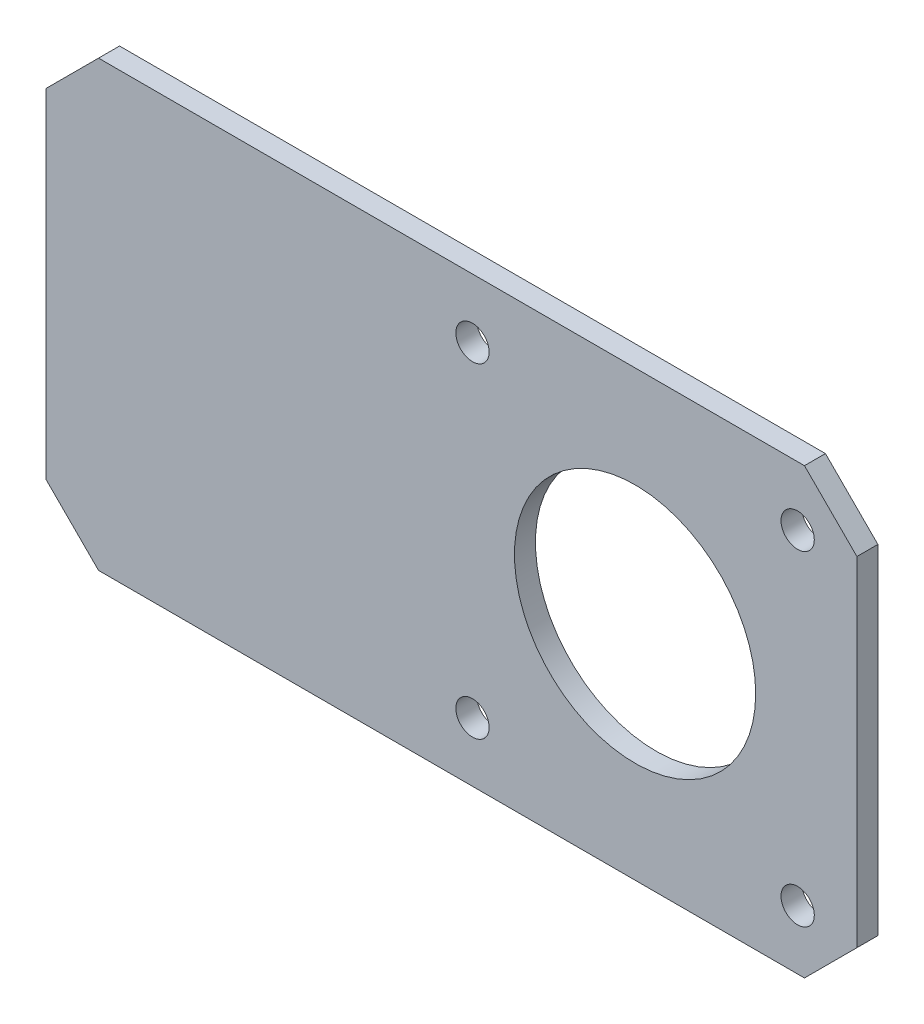
ISO-10303-21;
HEADER;
FILE_DESCRIPTION(('STEP AP214'),'2;1');
FILE_NAME('part.step','',(''),(''),'','','');
FILE_SCHEMA(('AUTOMOTIVE_DESIGN { 1 0 10303 214 1 1 1 1 }'));
ENDSEC;
DATA;
#1=APPLICATION_CONTEXT('core data for automotive mechanical design processes');
#2=APPLICATION_PROTOCOL_DEFINITION('international standard','automotive_design',2000,#1);
#3=PRODUCT_CONTEXT('',#1,'mechanical');
#4=PRODUCT('Part','Part','',(#3));
#5=PRODUCT_RELATED_PRODUCT_CATEGORY('part','',(#4));
#6=PRODUCT_DEFINITION_FORMATION('','',#4);
#7=PRODUCT_DEFINITION_CONTEXT('part definition',#1,'design');
#8=PRODUCT_DEFINITION('design','',#6,#7);
#9=PRODUCT_DEFINITION_SHAPE('','',#8);
#10=(LENGTH_UNIT() NAMED_UNIT(*) SI_UNIT(.MILLI.,.METRE.));
#11=(NAMED_UNIT(*) PLANE_ANGLE_UNIT() SI_UNIT($,.RADIAN.));
#12=(NAMED_UNIT(*) SI_UNIT($,.STERADIAN.) SOLID_ANGLE_UNIT());
#13=UNCERTAINTY_MEASURE_WITH_UNIT(LENGTH_MEASURE(1.E-05),#10,'distance_accuracy_value','');
#14=(GEOMETRIC_REPRESENTATION_CONTEXT(3) GLOBAL_UNCERTAINTY_ASSIGNED_CONTEXT((#13)) GLOBAL_UNIT_ASSIGNED_CONTEXT((#10,
#11,#12)) REPRESENTATION_CONTEXT('',''));
#15=CARTESIAN_POINT('',(0.,0.,0.));
#16=DIRECTION('',(0.,0.,1.));
#17=DIRECTION('',(1.,0.,0.));
#18=AXIS2_PLACEMENT_3D('',#15,#16,#17);
#19=CARTESIAN_POINT('',(0.,21.15,2.));
#20=DIRECTION('',(0.,-1.,0.));
#21=DIRECTION('',(1.,0.,0.));
#22=AXIS2_PLACEMENT_3D('',#19,#20,#21);
#23=PLANE('',#22);
#24=DIRECTION('',(-1.,0.,0.));
#25=VECTOR('',#24,1.);
#26=CARTESIAN_POINT('',(0.,21.15,2.));
#27=LINE('',#26,#25);
#28=CARTESIAN_POINT('',(16.15,21.15,2.));
#29=VERTEX_POINT('',#28);
#30=CARTESIAN_POINT('',(-51.15,21.15,2.));
#31=VERTEX_POINT('',#30);
#32=EDGE_CURVE('E125',#29,#31,#27,.T.);
#33=ORIENTED_EDGE('',*,*,#32,.F.);
#34=DIRECTION('',(0.,0.,-1.));
#35=VECTOR('',#34,1.);
#36=CARTESIAN_POINT('',(16.15,21.15,2.));
#37=LINE('',#36,#35);
#38=CARTESIAN_POINT('',(16.15,21.15,0.));
#39=VERTEX_POINT('',#38);
#40=EDGE_CURVE('E151',#29,#39,#37,.T.);
#41=ORIENTED_EDGE('',*,*,#40,.T.);
#42=DIRECTION('',(-1.,0.,0.));
#43=VECTOR('',#42,1.);
#44=CARTESIAN_POINT('',(0.,21.15,0.));
#45=LINE('',#44,#43);
#46=CARTESIAN_POINT('',(-51.15,21.15,0.));
#47=VERTEX_POINT('',#46);
#48=EDGE_CURVE('E157',#39,#47,#45,.T.);
#49=ORIENTED_EDGE('',*,*,#48,.T.);
#50=DIRECTION('',(0.,0.,1.));
#51=VECTOR('',#50,1.);
#52=CARTESIAN_POINT('',(-51.15,21.15,2.));
#53=LINE('',#52,#51);
#54=EDGE_CURVE('E149',#47,#31,#53,.T.);
#55=ORIENTED_EDGE('',*,*,#54,.T.);
#56=EDGE_LOOP('',(#33,#41,#49,#55));
#57=FACE_BOUND('',#56,.T.);
#58=ADVANCED_FACE('F33',(#57),#23,.F.);
#59=CARTESIAN_POINT('',(-56.15,0.,2.));
#60=DIRECTION('',(1.,0.,0.));
#61=DIRECTION('',(0.,1.,0.));
#62=AXIS2_PLACEMENT_3D('',#59,#60,#61);
#63=PLANE('',#62);
#64=DIRECTION('',(0.,-1.,0.));
#65=VECTOR('',#64,1.);
#66=CARTESIAN_POINT('',(-56.15,0.,2.));
#67=LINE('',#66,#65);
#68=CARTESIAN_POINT('',(-56.15,16.15,2.));
#69=VERTEX_POINT('',#68);
#70=CARTESIAN_POINT('',(-56.15,-16.15,2.));
#71=VERTEX_POINT('',#70);
#72=EDGE_CURVE('E128',#69,#71,#67,.T.);
#73=ORIENTED_EDGE('',*,*,#72,.F.);
#74=DIRECTION('',(0.,0.,-1.));
#75=VECTOR('',#74,1.);
#76=CARTESIAN_POINT('',(-56.15,16.15,2.));
#77=LINE('',#76,#75);
#78=CARTESIAN_POINT('',(-56.15,16.15,0.));
#79=VERTEX_POINT('',#78);
#80=EDGE_CURVE('E11',#69,#79,#77,.T.);
#81=ORIENTED_EDGE('',*,*,#80,.T.);
#82=DIRECTION('',(0.,-1.,0.));
#83=VECTOR('',#82,1.);
#84=CARTESIAN_POINT('',(-56.15,0.,0.));
#85=LINE('',#84,#83);
#86=CARTESIAN_POINT('',(-56.15,-16.15,0.));
#87=VERTEX_POINT('',#86);
#88=EDGE_CURVE('E130',#79,#87,#85,.T.);
#89=ORIENTED_EDGE('',*,*,#88,.T.);
#90=DIRECTION('',(0.,0.,1.));
#91=VECTOR('',#90,1.);
#92=CARTESIAN_POINT('',(-56.15,-16.15,2.));
#93=LINE('',#92,#91);
#94=EDGE_CURVE('E41',#87,#71,#93,.T.);
#95=ORIENTED_EDGE('',*,*,#94,.T.);
#96=EDGE_LOOP('',(#73,#81,#89,#95));
#97=FACE_BOUND('',#96,.T.);
#98=ADVANCED_FACE('F226',(#97),#63,.F.);
#99=CARTESIAN_POINT('',(0.,-21.15,2.));
#100=DIRECTION('',(0.,-1.,0.));
#101=DIRECTION('',(1.,0.,0.));
#102=AXIS2_PLACEMENT_3D('',#99,#100,#101);
#103=PLANE('',#102);
#104=DIRECTION('',(-1.,0.,0.));
#105=VECTOR('',#104,1.);
#106=CARTESIAN_POINT('',(0.,-21.15,0.));
#107=LINE('',#106,#105);
#108=CARTESIAN_POINT('',(16.15,-21.15,0.));
#109=VERTEX_POINT('',#108);
#110=CARTESIAN_POINT('',(-51.15,-21.15,0.));
#111=VERTEX_POINT('',#110);
#112=EDGE_CURVE('E126',#109,#111,#107,.T.);
#113=ORIENTED_EDGE('',*,*,#112,.F.);
#114=DIRECTION('',(0.,0.,1.));
#115=VECTOR('',#114,1.);
#116=CARTESIAN_POINT('',(16.15,-21.15,2.));
#117=LINE('',#116,#115);
#118=CARTESIAN_POINT('',(16.15,-21.15,2.));
#119=VERTEX_POINT('',#118);
#120=EDGE_CURVE('E104',#109,#119,#117,.T.);
#121=ORIENTED_EDGE('',*,*,#120,.T.);
#122=DIRECTION('',(-1.,0.,0.));
#123=VECTOR('',#122,1.);
#124=CARTESIAN_POINT('',(0.,-21.15,2.));
#125=LINE('',#124,#123);
#126=CARTESIAN_POINT('',(-51.15,-21.15,2.));
#127=VERTEX_POINT('',#126);
#128=EDGE_CURVE('E169',#119,#127,#125,.T.);
#129=ORIENTED_EDGE('',*,*,#128,.T.);
#130=DIRECTION('',(0.,0.,-1.));
#131=VECTOR('',#130,1.);
#132=CARTESIAN_POINT('',(-51.15,-21.15,0.));
#133=LINE('',#132,#131);
#134=EDGE_CURVE('E109',#127,#111,#133,.T.);
#135=ORIENTED_EDGE('',*,*,#134,.T.);
#136=EDGE_LOOP('',(#113,#121,#129,#135));
#137=FACE_BOUND('',#136,.T.);
#138=ADVANCED_FACE('F224',(#137),#103,.T.);
#139=CARTESIAN_POINT('',(21.15,0.,2.));
#140=DIRECTION('',(-1.,0.,0.));
#141=DIRECTION('',(0.,0.,1.));
#142=AXIS2_PLACEMENT_3D('',#139,#140,#141);
#143=PLANE('',#142);
#144=DIRECTION('',(0.,1.,0.));
#145=VECTOR('',#144,1.);
#146=CARTESIAN_POINT('',(21.15,0.,2.));
#147=LINE('',#146,#145);
#148=CARTESIAN_POINT('',(21.15,-16.15,2.));
#149=VERTEX_POINT('',#148);
#150=CARTESIAN_POINT('',(21.15,16.15,2.));
#151=VERTEX_POINT('',#150);
#152=EDGE_CURVE('E119',#149,#151,#147,.T.);
#153=ORIENTED_EDGE('',*,*,#152,.F.);
#154=DIRECTION('',(0.,0.,-1.));
#155=VECTOR('',#154,1.);
#156=CARTESIAN_POINT('',(21.15,-16.15,0.));
#157=LINE('',#156,#155);
#158=CARTESIAN_POINT('',(21.15,-16.15,0.));
#159=VERTEX_POINT('',#158);
#160=EDGE_CURVE('E103',#149,#159,#157,.T.);
#161=ORIENTED_EDGE('',*,*,#160,.T.);
#162=DIRECTION('',(0.,1.,0.));
#163=VECTOR('',#162,1.);
#164=CARTESIAN_POINT('',(21.15,0.,0.));
#165=LINE('',#164,#163);
#166=CARTESIAN_POINT('',(21.15,16.15,0.));
#167=VERTEX_POINT('',#166);
#168=EDGE_CURVE('E116',#159,#167,#165,.T.);
#169=ORIENTED_EDGE('',*,*,#168,.T.);
#170=DIRECTION('',(0.,0.,1.));
#171=VECTOR('',#170,1.);
#172=CARTESIAN_POINT('',(21.15,16.15,2.));
#173=LINE('',#172,#171);
#174=EDGE_CURVE('E121',#167,#151,#173,.T.);
#175=ORIENTED_EDGE('',*,*,#174,.T.);
#176=EDGE_LOOP('',(#153,#161,#169,#175));
#177=FACE_BOUND('',#176,.T.);
#178=ADVANCED_FACE('F115',(#177),#143,.F.);
#179=CARTESIAN_POINT('',(0.,0.,2.));
#180=DIRECTION('',(0.,0.,1.));
#181=DIRECTION('',(1.,0.,0.));
#182=AXIS2_PLACEMENT_3D('',#179,#180,#181);
#183=PLANE('',#182);
#184=CARTESIAN_POINT('',(0.,0.,2.));
#185=DIRECTION('',(0.,0.,1.));
#186=DIRECTION('',(1.,0.,0.));
#187=AXIS2_PLACEMENT_3D('',#184,#185,#186);
#188=CIRCLE('',#187,11.5);
#189=CARTESIAN_POINT('',(11.5,0.,2.));
#190=VERTEX_POINT('',#189);
#191=EDGE_CURVE('E194',#190,#190,#188,.T.);
#192=ORIENTED_EDGE('',*,*,#191,.F.);
#193=EDGE_LOOP('',(#192));
#194=FACE_BOUND('',#193,.T.);
#195=CARTESIAN_POINT('',(-15.5,15.5,2.));
#196=DIRECTION('',(0.,0.,1.));
#197=DIRECTION('',(1.,0.,0.));
#198=AXIS2_PLACEMENT_3D('',#195,#196,#197);
#199=CIRCLE('',#198,1.5875);
#200=CARTESIAN_POINT('',(-13.9125,15.5,2.));
#201=VERTEX_POINT('',#200);
#202=EDGE_CURVE('E190',#201,#201,#199,.T.);
#203=ORIENTED_EDGE('',*,*,#202,.F.);
#204=EDGE_LOOP('',(#203));
#205=FACE_BOUND('',#204,.T.);
#206=CARTESIAN_POINT('',(15.5,15.5,2.));
#207=DIRECTION('',(0.,0.,1.));
#208=DIRECTION('',(1.,0.,0.));
#209=AXIS2_PLACEMENT_3D('',#206,#207,#208);
#210=CIRCLE('',#209,1.5875);
#211=CARTESIAN_POINT('',(17.0875,15.5,2.));
#212=VERTEX_POINT('',#211);
#213=EDGE_CURVE('E184',#212,#212,#210,.T.);
#214=ORIENTED_EDGE('',*,*,#213,.F.);
#215=EDGE_LOOP('',(#214));
#216=FACE_BOUND('',#215,.T.);
#217=CARTESIAN_POINT('',(15.5,-15.5,2.));
#218=DIRECTION('',(0.,0.,1.));
#219=DIRECTION('',(1.,0.,0.));
#220=AXIS2_PLACEMENT_3D('',#217,#218,#219);
#221=CIRCLE('',#220,1.5875);
#222=CARTESIAN_POINT('',(17.0875,-15.5,2.));
#223=VERTEX_POINT('',#222);
#224=EDGE_CURVE('E178',#223,#223,#221,.T.);
#225=ORIENTED_EDGE('',*,*,#224,.F.);
#226=EDGE_LOOP('',(#225));
#227=FACE_BOUND('',#226,.T.);
#228=CARTESIAN_POINT('',(-15.5,-15.5,2.));
#229=DIRECTION('',(0.,0.,1.));
#230=DIRECTION('',(1.,0.,0.));
#231=AXIS2_PLACEMENT_3D('',#228,#229,#230);
#232=CIRCLE('',#231,1.5875);
#233=CARTESIAN_POINT('',(-13.9125,-15.5,2.));
#234=VERTEX_POINT('',#233);
#235=EDGE_CURVE('E165',#234,#234,#232,.T.);
#236=ORIENTED_EDGE('',*,*,#235,.F.);
#237=EDGE_LOOP('',(#236));
#238=FACE_BOUND('',#237,.T.);
#239=ORIENTED_EDGE('',*,*,#128,.F.);
#240=DIRECTION('',(0.707106781186548,0.707106781186547,0.));
#241=VECTOR('',#240,1.);
#242=CARTESIAN_POINT('',(18.65,-18.65,2.));
#243=LINE('',#242,#241);
#244=EDGE_CURVE('E147',#119,#149,#243,.T.);
#245=ORIENTED_EDGE('',*,*,#244,.T.);
#246=ORIENTED_EDGE('',*,*,#152,.T.);
#247=DIRECTION('',(0.707106781186546,-0.707106781186549,0.));
#248=VECTOR('',#247,1.);
#249=CARTESIAN_POINT('',(18.65,18.65,2.));
#250=LINE('',#249,#248);
#251=EDGE_CURVE('E145',#151,#29,#250,.F.);
#252=ORIENTED_EDGE('',*,*,#251,.T.);
#253=ORIENTED_EDGE('',*,*,#32,.T.);
#254=DIRECTION('',(0.707106781186547,0.707106781186548,0.));
#255=VECTOR('',#254,1.);
#256=CARTESIAN_POINT('',(-36.15,36.15,2.));
#257=LINE('',#256,#255);
#258=EDGE_CURVE('E54',#31,#69,#257,.F.);
#259=ORIENTED_EDGE('',*,*,#258,.T.);
#260=ORIENTED_EDGE('',*,*,#72,.T.);
#261=DIRECTION('',(0.707106781186546,-0.707106781186549,0.));
#262=VECTOR('',#261,1.);
#263=CARTESIAN_POINT('',(-36.1500000000001,-36.1499999999999,2.));
#264=LINE('',#263,#262);
#265=EDGE_CURVE('E142',#71,#127,#264,.T.);
#266=ORIENTED_EDGE('',*,*,#265,.T.);
#267=EDGE_LOOP('',(#239,#245,#246,#252,#253,#259,#260,#266));
#268=FACE_BOUND('',#267,.T.);
#269=ADVANCED_FACE('F209',(#194,#205,#216,#227,#238,#268),#183,.T.);
#270=CARTESIAN_POINT('',(0.,0.,0.));
#271=DIRECTION('',(0.,0.,1.));
#272=DIRECTION('',(1.,0.,0.));
#273=AXIS2_PLACEMENT_3D('',#270,#271,#272);
#274=PLANE('',#273);
#275=CARTESIAN_POINT('',(0.,0.,0.));
#276=DIRECTION('',(0.,0.,1.));
#277=DIRECTION('',(1.,0.,0.));
#278=AXIS2_PLACEMENT_3D('',#275,#276,#277);
#279=CIRCLE('',#278,11.5);
#280=CARTESIAN_POINT('',(11.5,0.,0.));
#281=VERTEX_POINT('',#280);
#282=EDGE_CURVE('E193',#281,#281,#279,.T.);
#283=ORIENTED_EDGE('',*,*,#282,.T.);
#284=EDGE_LOOP('',(#283));
#285=FACE_BOUND('',#284,.T.);
#286=CARTESIAN_POINT('',(-15.5,15.5,0.));
#287=DIRECTION('',(0.,0.,1.));
#288=DIRECTION('',(1.,0.,0.));
#289=AXIS2_PLACEMENT_3D('',#286,#287,#288);
#290=CIRCLE('',#289,1.5875);
#291=CARTESIAN_POINT('',(-13.9125,15.5,0.));
#292=VERTEX_POINT('',#291);
#293=EDGE_CURVE('E187',#292,#292,#290,.T.);
#294=ORIENTED_EDGE('',*,*,#293,.T.);
#295=EDGE_LOOP('',(#294));
#296=FACE_BOUND('',#295,.T.);
#297=CARTESIAN_POINT('',(15.5,15.5,0.));
#298=DIRECTION('',(0.,0.,1.));
#299=DIRECTION('',(1.,0.,0.));
#300=AXIS2_PLACEMENT_3D('',#297,#298,#299);
#301=CIRCLE('',#300,1.5875);
#302=CARTESIAN_POINT('',(17.0875,15.5,0.));
#303=VERTEX_POINT('',#302);
#304=EDGE_CURVE('E181',#303,#303,#301,.T.);
#305=ORIENTED_EDGE('',*,*,#304,.T.);
#306=EDGE_LOOP('',(#305));
#307=FACE_BOUND('',#306,.T.);
#308=CARTESIAN_POINT('',(15.5,-15.5,0.));
#309=DIRECTION('',(0.,0.,1.));
#310=DIRECTION('',(1.,0.,0.));
#311=AXIS2_PLACEMENT_3D('',#308,#309,#310);
#312=CIRCLE('',#311,1.5875);
#313=CARTESIAN_POINT('',(17.0875,-15.5,0.));
#314=VERTEX_POINT('',#313);
#315=EDGE_CURVE('E175',#314,#314,#312,.T.);
#316=ORIENTED_EDGE('',*,*,#315,.T.);
#317=EDGE_LOOP('',(#316));
#318=FACE_BOUND('',#317,.T.);
#319=CARTESIAN_POINT('',(-15.5,-15.5,0.));
#320=DIRECTION('',(0.,0.,1.));
#321=DIRECTION('',(1.,0.,0.));
#322=AXIS2_PLACEMENT_3D('',#319,#320,#321);
#323=CIRCLE('',#322,1.5875);
#324=CARTESIAN_POINT('',(-13.9125,-15.5,0.));
#325=VERTEX_POINT('',#324);
#326=EDGE_CURVE('E162',#325,#325,#323,.T.);
#327=ORIENTED_EDGE('',*,*,#326,.T.);
#328=EDGE_LOOP('',(#327));
#329=FACE_BOUND('',#328,.T.);
#330=ORIENTED_EDGE('',*,*,#168,.F.);
#331=DIRECTION('',(-0.707106781186548,-0.707106781186547,0.));
#332=VECTOR('',#331,1.);
#333=CARTESIAN_POINT('',(21.15,-16.15,0.));
#334=LINE('',#333,#332);
#335=EDGE_CURVE('E99',#159,#109,#334,.T.);
#336=ORIENTED_EDGE('',*,*,#335,.T.);
#337=ORIENTED_EDGE('',*,*,#112,.T.);
#338=DIRECTION('',(-0.707106781186546,0.707106781186549,0.));
#339=VECTOR('',#338,1.);
#340=CARTESIAN_POINT('',(-51.15,-21.15,0.));
#341=LINE('',#340,#339);
#342=EDGE_CURVE('E120',#111,#87,#341,.T.);
#343=ORIENTED_EDGE('',*,*,#342,.T.);
#344=ORIENTED_EDGE('',*,*,#88,.F.);
#345=DIRECTION('',(-0.707106781186547,-0.707106781186548,0.));
#346=VECTOR('',#345,1.);
#347=CARTESIAN_POINT('',(-56.15,16.15,0.));
#348=LINE('',#347,#346);
#349=EDGE_CURVE('E136',#79,#47,#348,.F.);
#350=ORIENTED_EDGE('',*,*,#349,.T.);
#351=ORIENTED_EDGE('',*,*,#48,.F.);
#352=DIRECTION('',(-0.707106781186546,0.707106781186549,0.));
#353=VECTOR('',#352,1.);
#354=CARTESIAN_POINT('',(16.15,21.15,0.));
#355=LINE('',#354,#353);
#356=EDGE_CURVE('E110',#39,#167,#355,.F.);
#357=ORIENTED_EDGE('',*,*,#356,.T.);
#358=EDGE_LOOP('',(#330,#336,#337,#343,#344,#350,#351,#357));
#359=FACE_BOUND('',#358,.T.);
#360=ADVANCED_FACE('F123',(#285,#296,#307,#318,#329,#359),#274,.F.);
#361=CARTESIAN_POINT('',(-15.5,-15.5,2.));
#362=DIRECTION('',(0.,0.,1.));
#363=DIRECTION('',(1.,0.,0.));
#364=AXIS2_PLACEMENT_3D('',#361,#362,#363);
#365=CYLINDRICAL_SURFACE('',#364,1.5875);
#366=ORIENTED_EDGE('',*,*,#235,.T.);
#367=EDGE_LOOP('',(#366));
#368=FACE_BOUND('',#367,.T.);
#369=ORIENTED_EDGE('',*,*,#326,.F.);
#370=EDGE_LOOP('',(#369));
#371=FACE_BOUND('',#370,.T.);
#372=ADVANCED_FACE('F250',(#368,#371),#365,.F.);
#373=CARTESIAN_POINT('',(15.5,-15.5,2.));
#374=DIRECTION('',(0.,0.,1.));
#375=DIRECTION('',(1.,0.,0.));
#376=AXIS2_PLACEMENT_3D('',#373,#374,#375);
#377=CYLINDRICAL_SURFACE('',#376,1.5875);
#378=ORIENTED_EDGE('',*,*,#224,.T.);
#379=EDGE_LOOP('',(#378));
#380=FACE_BOUND('',#379,.T.);
#381=ORIENTED_EDGE('',*,*,#315,.F.);
#382=EDGE_LOOP('',(#381));
#383=FACE_BOUND('',#382,.T.);
#384=ADVANCED_FACE('F254',(#380,#383),#377,.F.);
#385=CARTESIAN_POINT('',(15.5,15.5,2.));
#386=DIRECTION('',(0.,0.,1.));
#387=DIRECTION('',(1.,0.,0.));
#388=AXIS2_PLACEMENT_3D('',#385,#386,#387);
#389=CYLINDRICAL_SURFACE('',#388,1.5875);
#390=ORIENTED_EDGE('',*,*,#213,.T.);
#391=EDGE_LOOP('',(#390));
#392=FACE_BOUND('',#391,.T.);
#393=ORIENTED_EDGE('',*,*,#304,.F.);
#394=EDGE_LOOP('',(#393));
#395=FACE_BOUND('',#394,.T.);
#396=ADVANCED_FACE('F258',(#392,#395),#389,.F.);
#397=CARTESIAN_POINT('',(-15.5,15.5,2.));
#398=DIRECTION('',(0.,0.,1.));
#399=DIRECTION('',(1.,0.,0.));
#400=AXIS2_PLACEMENT_3D('',#397,#398,#399);
#401=CYLINDRICAL_SURFACE('',#400,1.5875);
#402=ORIENTED_EDGE('',*,*,#202,.T.);
#403=EDGE_LOOP('',(#402));
#404=FACE_BOUND('',#403,.T.);
#405=ORIENTED_EDGE('',*,*,#293,.F.);
#406=EDGE_LOOP('',(#405));
#407=FACE_BOUND('',#406,.T.);
#408=ADVANCED_FACE('F205',(#404,#407),#401,.F.);
#409=CARTESIAN_POINT('',(0.,0.,0.));
#410=DIRECTION('',(0.,0.,1.));
#411=DIRECTION('',(1.,0.,0.));
#412=AXIS2_PLACEMENT_3D('',#409,#410,#411);
#413=CYLINDRICAL_SURFACE('',#412,11.5);
#414=ORIENTED_EDGE('',*,*,#282,.F.);
#415=EDGE_LOOP('',(#414));
#416=FACE_BOUND('',#415,.T.);
#417=ORIENTED_EDGE('',*,*,#191,.T.);
#418=EDGE_LOOP('',(#417));
#419=FACE_BOUND('',#418,.T.);
#420=ADVANCED_FACE('F202',(#416,#419),#413,.F.);
#421=CARTESIAN_POINT('',(21.15,-16.15,2.));
#422=DIRECTION('',(0.707106781186547,-0.707106781186548,0.));
#423=DIRECTION('',(0.,0.,1.));
#424=AXIS2_PLACEMENT_3D('',#421,#422,#423);
#425=PLANE('',#424);
#426=ORIENTED_EDGE('',*,*,#244,.F.);
#427=ORIENTED_EDGE('',*,*,#120,.F.);
#428=ORIENTED_EDGE('',*,*,#335,.F.);
#429=ORIENTED_EDGE('',*,*,#160,.F.);
#430=EDGE_LOOP('',(#426,#427,#428,#429));
#431=FACE_BOUND('',#430,.T.);
#432=ADVANCED_FACE('F102',(#431),#425,.T.);
#433=CARTESIAN_POINT('',(16.15,21.15,2.));
#434=DIRECTION('',(-0.707106781186549,-0.707106781186546,0.));
#435=DIRECTION('',(0.,0.,-1.));
#436=AXIS2_PLACEMENT_3D('',#433,#434,#435);
#437=PLANE('',#436);
#438=ORIENTED_EDGE('',*,*,#251,.F.);
#439=ORIENTED_EDGE('',*,*,#174,.F.);
#440=ORIENTED_EDGE('',*,*,#356,.F.);
#441=ORIENTED_EDGE('',*,*,#40,.F.);
#442=EDGE_LOOP('',(#438,#439,#440,#441));
#443=FACE_BOUND('',#442,.T.);
#444=ADVANCED_FACE('F230',(#443),#437,.F.);
#445=CARTESIAN_POINT('',(-56.15,16.15,2.));
#446=DIRECTION('',(0.707106781186548,-0.707106781186547,0.));
#447=DIRECTION('',(0.,0.,-1.));
#448=AXIS2_PLACEMENT_3D('',#445,#446,#447);
#449=PLANE('',#448);
#450=ORIENTED_EDGE('',*,*,#258,.F.);
#451=ORIENTED_EDGE('',*,*,#54,.F.);
#452=ORIENTED_EDGE('',*,*,#349,.F.);
#453=ORIENTED_EDGE('',*,*,#80,.F.);
#454=EDGE_LOOP('',(#450,#451,#452,#453));
#455=FACE_BOUND('',#454,.T.);
#456=ADVANCED_FACE('F229',(#455),#449,.F.);
#457=CARTESIAN_POINT('',(-51.15,-21.15,2.));
#458=DIRECTION('',(-0.707106781186549,-0.707106781186546,0.));
#459=DIRECTION('',(0.,0.,1.));
#460=AXIS2_PLACEMENT_3D('',#457,#458,#459);
#461=PLANE('',#460);
#462=ORIENTED_EDGE('',*,*,#265,.F.);
#463=ORIENTED_EDGE('',*,*,#94,.F.);
#464=ORIENTED_EDGE('',*,*,#342,.F.);
#465=ORIENTED_EDGE('',*,*,#134,.F.);
#466=EDGE_LOOP('',(#462,#463,#464,#465));
#467=FACE_BOUND('',#466,.T.);
#468=ADVANCED_FACE('F35',(#467),#461,.T.);
#469=CLOSED_SHELL('',(#58,#98,#138,#178,#269,#360,#372,#384,#396,#408,#420,#432,#444,#456,#468));
#470=MANIFOLD_SOLID_BREP('B2',#469);
#471=ADVANCED_BREP_SHAPE_REPRESENTATION('',(#18,#470),#14);
#472=SHAPE_DEFINITION_REPRESENTATION(#9,#471);
ENDSEC;
END-ISO-10303-21;
